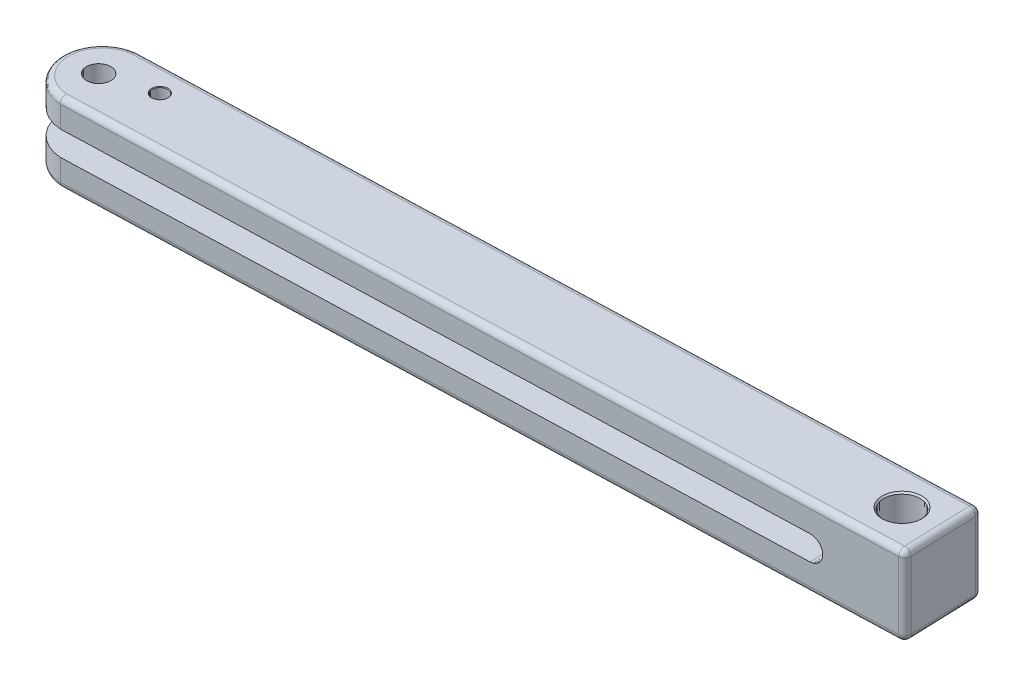
ISO-10303-21;
HEADER;
FILE_DESCRIPTION(('STEP AP214'),'2;1');
FILE_NAME('part.step','',(''),(''),'','','');
FILE_SCHEMA(('AUTOMOTIVE_DESIGN { 1 0 10303 214 1 1 1 1 }'));
ENDSEC;
DATA;
#1=APPLICATION_CONTEXT('core data for automotive mechanical design processes');
#2=APPLICATION_PROTOCOL_DEFINITION('international standard','automotive_design',2000,#1);
#3=PRODUCT_CONTEXT('',#1,'mechanical');
#4=PRODUCT('Part','Part','',(#3));
#5=PRODUCT_RELATED_PRODUCT_CATEGORY('part','',(#4));
#6=PRODUCT_DEFINITION_FORMATION('','',#4);
#7=PRODUCT_DEFINITION_CONTEXT('part definition',#1,'design');
#8=PRODUCT_DEFINITION('design','',#6,#7);
#9=PRODUCT_DEFINITION_SHAPE('','',#8);
#10=(LENGTH_UNIT() NAMED_UNIT(*) SI_UNIT(.MILLI.,.METRE.));
#11=(NAMED_UNIT(*) PLANE_ANGLE_UNIT() SI_UNIT($,.RADIAN.));
#12=(NAMED_UNIT(*) SI_UNIT($,.STERADIAN.) SOLID_ANGLE_UNIT());
#13=UNCERTAINTY_MEASURE_WITH_UNIT(LENGTH_MEASURE(1.E-05),#10,'distance_accuracy_value','');
#14=(GEOMETRIC_REPRESENTATION_CONTEXT(3) GLOBAL_UNCERTAINTY_ASSIGNED_CONTEXT((#13)) GLOBAL_UNIT_ASSIGNED_CONTEXT((#10,
#11,#12)) REPRESENTATION_CONTEXT('',''));
#15=CARTESIAN_POINT('',(0.,0.,0.));
#16=DIRECTION('',(0.,0.,1.));
#17=DIRECTION('',(1.,0.,0.));
#18=AXIS2_PLACEMENT_3D('',#15,#16,#17);
#19=CARTESIAN_POINT('',(5.24913966861859,-6.5,-1.));
#20=DIRECTION('',(0.0337078651685393,0.,0.999431728446611));
#21=DIRECTION('',(0.999431728446611,0.,-0.0337078651685393));
#22=AXIS2_PLACEMENT_3D('',#19,#20,#21);
#23=PLANE('',#22);
#24=DIRECTION('',(0.,1.,0.));
#25=VECTOR('',#24,1.);
#26=CARTESIAN_POINT('',(5.24913966861859,-6.5,-1.));
#27=LINE('',#26,#25);
#28=CARTESIAN_POINT('',(5.24913966861859,-5.5,-1.));
#29=VERTEX_POINT('',#28);
#30=CARTESIAN_POINT('',(5.2491396686186,-1.99999999999999,-1.));
#31=VERTEX_POINT('',#30);
#32=EDGE_CURVE('E249',#29,#31,#27,.T.);
#33=ORIENTED_EDGE('',*,*,#32,.F.);
#34=DIRECTION('',(0.999431728446611,0.,-0.0337078651685393));
#35=VECTOR('',#34,1.);
#36=CARTESIAN_POINT('',(138.673275416241,-5.5,-5.5));
#37=LINE('',#36,#35);
#38=CARTESIAN_POINT('',(137.673843687795,-5.5,-5.46629213483146));
#39=VERTEX_POINT('',#38);
#40=EDGE_CURVE('E336',#29,#39,#37,.T.);
#41=ORIENTED_EDGE('',*,*,#40,.T.);
#42=DIRECTION('',(0.,1.,0.));
#43=VECTOR('',#42,1.);
#44=CARTESIAN_POINT('',(137.673843687795,-6.5,-5.46629213483146));
#45=LINE('',#44,#43);
#46=CARTESIAN_POINT('',(137.673843687795,5.5,-5.46629213483146));
#47=VERTEX_POINT('',#46);
#48=EDGE_CURVE('E333',#39,#47,#45,.T.);
#49=ORIENTED_EDGE('',*,*,#48,.T.);
#50=DIRECTION('',(0.999431728446611,0.,-0.0337078651685393));
#51=VECTOR('',#50,1.);
#52=CARTESIAN_POINT('',(5.24913966861859,5.5,-1.));
#53=LINE('',#52,#51);
#54=CARTESIAN_POINT('',(5.24913966861859,5.5,-1.));
#55=VERTEX_POINT('',#54);
#56=EDGE_CURVE('E330',#47,#55,#53,.F.);
#57=ORIENTED_EDGE('',*,*,#56,.T.);
#58=CARTESIAN_POINT('',(5.2491396686186,1.99999999999999,-1.));
#59=VERTEX_POINT('',#58);
#60=EDGE_CURVE('E253',#59,#55,#27,.T.);
#61=ORIENTED_EDGE('',*,*,#60,.F.);
#62=DIRECTION('',(-0.999431728446611,0.,0.0337078651685393));
#63=VECTOR('',#62,1.);
#64=CARTESIAN_POINT('',(-0.0277245315588536,1.99999999999999,-0.822027036055045));
#65=LINE('',#64,#63);
#66=CARTESIAN_POINT('',(123.681799489542,2.,-4.99438202247191));
#67=VERTEX_POINT('',#66);
#68=EDGE_CURVE('E235',#67,#59,#65,.T.);
#69=ORIENTED_EDGE('',*,*,#68,.F.);
#70=CARTESIAN_POINT('',(123.681799489542,0.,-4.99438202247191));
#71=DIRECTION('',(0.0337078651685393,0.,0.999431728446611));
#72=DIRECTION('',(0.999431728446611,0.,-0.0337078651685393));
#73=AXIS2_PLACEMENT_3D('',#70,#71,#72);
#74=CIRCLE('',#73,2.);
#75=CARTESIAN_POINT('',(123.681799489542,-2.,-4.99438202247191));
#76=VERTEX_POINT('',#75);
#77=EDGE_CURVE('E213',#67,#76,#74,.F.);
#78=ORIENTED_EDGE('',*,*,#77,.T.);
#79=DIRECTION('',(-0.999431728446611,0.,0.0337078651685393));
#80=VECTOR('',#79,1.);
#81=CARTESIAN_POINT('',(-0.0277245315588536,-1.99999999999999,-0.822027036055045));
#82=LINE('',#81,#80);
#83=EDGE_CURVE('E223',#76,#31,#82,.T.);
#84=ORIENTED_EDGE('',*,*,#83,.T.);
#85=EDGE_LOOP('',(#33,#41,#49,#57,#61,#69,#78,#84));
#86=FACE_BOUND('',#85,.T.);
#87=ADVANCED_FACE('F49',(#86),#23,.T.);
#88=CARTESIAN_POINT('',(5.60265877617611,-6.5,-7.49037936029873));
#89=DIRECTION('',(0.,1.,0.));
#90=DIRECTION('',(0.,0.,1.));
#91=AXIS2_PLACEMENT_3D('',#88,#89,#90);
#92=CYLINDRICAL_SURFACE('',#91,6.5);
#93=DIRECTION('',(0.,1.,0.));
#94=VECTOR('',#93,1.);
#95=CARTESIAN_POINT('',(4.81263800426407,-6.5,-13.9421905153115));
#96=LINE('',#95,#94);
#97=CARTESIAN_POINT('',(4.81263800426407,-5.5,-13.9421905153115));
#98=VERTEX_POINT('',#97);
#99=CARTESIAN_POINT('',(4.81263800426407,-1.99999999999999,-13.9421905153115));
#100=VERTEX_POINT('',#99);
#101=EDGE_CURVE('E205',#98,#100,#96,.T.);
#102=ORIENTED_EDGE('',*,*,#101,.F.);
#103=CARTESIAN_POINT('',(5.60265877617611,-5.5,-7.49037936029873));
#104=DIRECTION('',(0.,1.,0.));
#105=DIRECTION('',(0.,0.,1.));
#106=AXIS2_PLACEMENT_3D('',#103,#104,#105);
#107=CIRCLE('',#106,6.5);
#108=EDGE_CURVE('E327',#98,#29,#107,.T.);
#109=ORIENTED_EDGE('',*,*,#108,.T.);
#110=ORIENTED_EDGE('',*,*,#32,.T.);
#111=CARTESIAN_POINT('',(5.60265877617611,-1.99999999999999,-7.49037936029873));
#112=DIRECTION('',(0.,1.,0.));
#113=DIRECTION('',(-1.,0.,0.));
#114=AXIS2_PLACEMENT_3D('',#111,#112,#113);
#115=CIRCLE('',#114,6.5);
#116=EDGE_CURVE('E208',#31,#100,#115,.F.);
#117=ORIENTED_EDGE('',*,*,#116,.T.);
#118=EDGE_LOOP('',(#102,#109,#110,#117));
#119=FACE_BOUND('',#118,.T.);
#120=ADVANCED_FACE('F457',(#119),#92,.T.);
#121=CARTESIAN_POINT('',(138.236773751887,-6.5,-18.4421905153116));
#122=DIRECTION('',(-0.0337078651685397,0.,-0.999431728446611));
#123=DIRECTION('',(-0.999431728446611,0.,0.0337078651685397));
#124=AXIS2_PLACEMENT_3D('',#121,#122,#123);
#125=PLANE('',#124);
#126=DIRECTION('',(0.,1.,0.));
#127=VECTOR('',#126,1.);
#128=CARTESIAN_POINT('',(137.23734202344,-6.5,-18.408482650143));
#129=LINE('',#128,#127);
#130=CARTESIAN_POINT('',(137.23734202344,5.5,-18.408482650143));
#131=VERTEX_POINT('',#130);
#132=CARTESIAN_POINT('',(137.23734202344,-5.5,-18.408482650143));
#133=VERTEX_POINT('',#132);
#134=EDGE_CURVE('E321',#131,#133,#129,.F.);
#135=ORIENTED_EDGE('',*,*,#134,.T.);
#136=DIRECTION('',(-0.999431728446611,0.,0.0337078651685397));
#137=VECTOR('',#136,1.);
#138=CARTESIAN_POINT('',(4.81263800426407,-5.5,-13.9421905153115));
#139=LINE('',#138,#137);
#140=EDGE_CURVE('E324',#133,#98,#139,.T.);
#141=ORIENTED_EDGE('',*,*,#140,.T.);
#142=ORIENTED_EDGE('',*,*,#101,.T.);
#143=DIRECTION('',(0.999431728446611,0.,-0.0337078651685397));
#144=VECTOR('',#143,1.);
#145=CARTESIAN_POINT('',(138.236773751887,-2.,-18.4421905153116));
#146=LINE('',#145,#144);
#147=CARTESIAN_POINT('',(13.879577635795,-1.99999999999999,-14.2479914718871));
#148=VERTEX_POINT('',#147);
#149=EDGE_CURVE('E195',#100,#148,#146,.T.);
#150=ORIENTED_EDGE('',*,*,#149,.T.);
#151=CARTESIAN_POINT('',(8.57049077011085,0.,-14.0689317330946));
#152=DIRECTION('',(-0.0337078651685397,0.,-0.999431728446611));
#153=DIRECTION('',(-0.999431728446611,0.,0.0337078651685397));
#154=AXIS2_PLACEMENT_3D('',#151,#152,#153);
#155=CIRCLE('',#154,5.67613122975822);
#156=CARTESIAN_POINT('',(13.879577635795,1.99999999999999,-14.2479914718871));
#157=VERTEX_POINT('',#156);
#158=EDGE_CURVE('E175',#157,#148,#155,.T.);
#159=ORIENTED_EDGE('',*,*,#158,.F.);
#160=DIRECTION('',(0.999431728446611,0.,-0.0337078651685397));
#161=VECTOR('',#160,1.);
#162=CARTESIAN_POINT('',(138.236773751887,2.,-18.4421905153116));
#163=LINE('',#162,#161);
#164=CARTESIAN_POINT('',(4.81263800426407,1.99999999999999,-13.9421905153115));
#165=VERTEX_POINT('',#164);
#166=EDGE_CURVE('E199',#165,#157,#163,.T.);
#167=ORIENTED_EDGE('',*,*,#166,.F.);
#168=CARTESIAN_POINT('',(4.81263800426407,5.5,-13.9421905153115));
#169=VERTEX_POINT('',#168);
#170=EDGE_CURVE('E245',#165,#169,#96,.T.);
#171=ORIENTED_EDGE('',*,*,#170,.T.);
#172=DIRECTION('',(-0.999431728446611,0.,0.0337078651685397));
#173=VECTOR('',#172,1.);
#174=CARTESIAN_POINT('',(138.236773751887,5.5,-18.4421905153116));
#175=LINE('',#174,#173);
#176=EDGE_CURVE('E318',#169,#131,#175,.F.);
#177=ORIENTED_EDGE('',*,*,#176,.T.);
#178=EDGE_LOOP('',(#135,#141,#142,#150,#159,#167,#171,#177));
#179=FACE_BOUND('',#178,.T.);
#180=ADVANCED_FACE('F203',(#179),#125,.T.);
#181=CARTESIAN_POINT('',(138.673275416241,-6.5,-5.5));
#182=DIRECTION('',(0.999431728446611,0.,-0.0337078651685386));
#183=DIRECTION('',(-0.0337078651685386,0.,-0.999431728446611));
#184=AXIS2_PLACEMENT_3D('',#181,#182,#183);
#185=PLANE('',#184);
#186=DIRECTION('',(0.,1.,0.));
#187=VECTOR('',#186,1.);
#188=CARTESIAN_POINT('',(138.639567551073,-6.5,-6.49943172844661));
#189=LINE('',#188,#187);
#190=CARTESIAN_POINT('',(138.639567551073,5.5,-6.49943172844661));
#191=VERTEX_POINT('',#190);
#192=CARTESIAN_POINT('',(138.639567551073,-5.5,-6.49943172844661));
#193=VERTEX_POINT('',#192);
#194=EDGE_CURVE('E295',#191,#193,#189,.F.);
#195=ORIENTED_EDGE('',*,*,#194,.T.);
#196=DIRECTION('',(-0.0337078651685386,0.,-0.999431728446611));
#197=VECTOR('',#196,1.);
#198=CARTESIAN_POINT('',(138.236773751887,-5.5,-18.4421905153116));
#199=LINE('',#198,#197);
#200=CARTESIAN_POINT('',(138.270481617055,-5.5,-17.442758786865));
#201=VERTEX_POINT('',#200);
#202=EDGE_CURVE('E301',#193,#201,#199,.T.);
#203=ORIENTED_EDGE('',*,*,#202,.T.);
#204=DIRECTION('',(0.,1.,0.));
#205=VECTOR('',#204,1.);
#206=CARTESIAN_POINT('',(138.270481617055,-6.5,-17.442758786865));
#207=LINE('',#206,#205);
#208=CARTESIAN_POINT('',(138.270481617055,5.5,-17.442758786865));
#209=VERTEX_POINT('',#208);
#210=EDGE_CURVE('E298',#201,#209,#207,.T.);
#211=ORIENTED_EDGE('',*,*,#210,.T.);
#212=DIRECTION('',(-0.0337078651685386,0.,-0.999431728446611));
#213=VECTOR('',#212,1.);
#214=CARTESIAN_POINT('',(138.673275416241,5.5,-5.5));
#215=LINE('',#214,#213);
#216=EDGE_CURVE('E292',#209,#191,#215,.F.);
#217=ORIENTED_EDGE('',*,*,#216,.T.);
#218=EDGE_LOOP('',(#195,#203,#211,#217));
#219=FACE_BOUND('',#218,.T.);
#220=ADVANCED_FACE('F473',(#219),#185,.T.);
#221=ORIENTED_EDGE('',*,*,#60,.T.);
#222=CARTESIAN_POINT('',(5.60265877617611,5.5,-7.49037936029873));
#223=DIRECTION('',(0.,1.,0.));
#224=DIRECTION('',(0.,0.,1.));
#225=AXIS2_PLACEMENT_3D('',#222,#223,#224);
#226=CIRCLE('',#225,6.5);
#227=EDGE_CURVE('E11',#55,#169,#226,.F.);
#228=ORIENTED_EDGE('',*,*,#227,.T.);
#229=ORIENTED_EDGE('',*,*,#170,.F.);
#230=CARTESIAN_POINT('',(5.60265877617611,1.99999999999999,-7.49037936029873));
#231=DIRECTION('',(0.,1.,0.));
#232=DIRECTION('',(-1.,0.,0.));
#233=AXIS2_PLACEMENT_3D('',#230,#231,#232);
#234=CIRCLE('',#233,6.5);
#235=EDGE_CURVE('E209',#59,#165,#234,.F.);
#236=ORIENTED_EDGE('',*,*,#235,.F.);
#237=EDGE_LOOP('',(#221,#228,#229,#236));
#238=FACE_BOUND('',#237,.T.);
#239=ADVANCED_FACE('F466',(#238),#92,.T.);
#240=CARTESIAN_POINT('',(5.60265877617611,-6.5,-7.49037936029873));
#241=DIRECTION('',(0.,1.,0.));
#242=DIRECTION('',(0.,0.,1.));
#243=AXIS2_PLACEMENT_3D('',#240,#241,#242);
#244=PLANE('',#243);
#245=DIRECTION('',(-0.999431728446611,0.,0.0337078651685397));
#246=VECTOR('',#245,1.);
#247=CARTESIAN_POINT('',(138.270481617055,-6.5,-17.442758786865));
#248=LINE('',#247,#246);
#249=CARTESIAN_POINT('',(4.89225692803838,-6.5,-12.9443072305737));
#250=VERTEX_POINT('',#249);
#251=CARTESIAN_POINT('',(137.271049888609,-6.5,-17.4090509216964));
#252=VERTEX_POINT('',#251);
#253=EDGE_CURVE('E311',#250,#252,#248,.F.);
#254=ORIENTED_EDGE('',*,*,#253,.T.);
#255=DIRECTION('',(-0.0337078651685386,0.,-0.999431728446611));
#256=VECTOR('',#255,1.);
#257=CARTESIAN_POINT('',(137.673843687795,-6.5,-5.46629213483146));
#258=LINE('',#257,#256);
#259=CARTESIAN_POINT('',(137.640135822626,-6.5,-6.46572386327807));
#260=VERTEX_POINT('',#259);
#261=EDGE_CURVE('E314',#252,#260,#258,.F.);
#262=ORIENTED_EDGE('',*,*,#261,.T.);
#263=DIRECTION('',(0.999431728446611,0.,-0.0337078651685393));
#264=VECTOR('',#263,1.);
#265=CARTESIAN_POINT('',(5.21543180345005,-6.5,-1.99943172844661));
#266=LINE('',#265,#264);
#267=CARTESIAN_POINT('',(5.26134286205578,-6.5,-2.00098017215635));
#268=VERTEX_POINT('',#267);
#269=EDGE_CURVE('E305',#260,#268,#266,.F.);
#270=ORIENTED_EDGE('',*,*,#269,.T.);
#271=CARTESIAN_POINT('',(5.60265877617611,-6.5,-7.49037936029873));
#272=DIRECTION('',(0.,1.,0.));
#273=DIRECTION('',(0.,0.,1.));
#274=AXIS2_PLACEMENT_3D('',#271,#272,#273);
#275=CIRCLE('',#274,5.5);
#276=EDGE_CURVE('E308',#268,#250,#275,.F.);
#277=ORIENTED_EDGE('',*,*,#276,.T.);
#278=EDGE_LOOP('',(#254,#262,#270,#277));
#279=FACE_BOUND('',#278,.T.);
#280=CARTESIAN_POINT('',(131.959568640579,-6.5,-11.7267831568131));
#281=DIRECTION('',(0.,1.,0.));
#282=DIRECTION('',(0.,0.,1.));
#283=AXIS2_PLACEMENT_3D('',#280,#281,#282);
#284=CIRCLE('',#283,3.24999999999995);
#285=CARTESIAN_POINT('',(131.959568640579,-6.5,-8.47678315681314));
#286=VERTEX_POINT('',#285);
#287=EDGE_CURVE('E288',#286,#286,#284,.T.);
#288=ORIENTED_EDGE('',*,*,#287,.T.);
#289=EDGE_LOOP('',(#288));
#290=FACE_BOUND('',#289,.T.);
#291=CARTESIAN_POINT('',(5.03088883644133,-6.5,-7.47109525765576));
#292=DIRECTION('',(0.,1.,0.));
#293=DIRECTION('',(0.,0.,1.));
#294=AXIS2_PLACEMENT_3D('',#291,#292,#293);
#295=CIRCLE('',#294,2.);
#296=CARTESIAN_POINT('',(5.03088883644133,-6.5,-5.47109525765576));
#297=VERTEX_POINT('',#296);
#298=EDGE_CURVE('E553',#297,#297,#295,.T.);
#299=ORIENTED_EDGE('',*,*,#298,.T.);
#300=EDGE_LOOP('',(#299));
#301=FACE_BOUND('',#300,.T.);
#302=CARTESIAN_POINT('',(12.7819733684952,-6.5,-9.70841386241665));
#303=DIRECTION('',(0.,1.,0.));
#304=DIRECTION('',(0.,0.,1.));
#305=AXIS2_PLACEMENT_3D('',#302,#303,#304);
#306=CIRCLE('',#305,1.34999999999992);
#307=CARTESIAN_POINT('',(12.7819733684952,-6.5,-8.35841386241673));
#308=VERTEX_POINT('',#307);
#309=EDGE_CURVE('E252',#308,#308,#306,.T.);
#310=ORIENTED_EDGE('',*,*,#309,.T.);
#311=EDGE_LOOP('',(#310));
#312=FACE_BOUND('',#311,.T.);
#313=ADVANCED_FACE('F469',(#279,#290,#301,#312),#244,.F.);
#314=CARTESIAN_POINT('',(5.60265877617611,6.5,-7.49037936029873));
#315=DIRECTION('',(0.,1.,0.));
#316=DIRECTION('',(0.,0.,1.));
#317=AXIS2_PLACEMENT_3D('',#314,#315,#316);
#318=PLANE('',#317);
#319=DIRECTION('',(0.999431728446611,0.,-0.0337078651685393));
#320=VECTOR('',#319,1.);
#321=CARTESIAN_POINT('',(5.78720174318483,6.5,-2.01871583108958));
#322=LINE('',#321,#320);
#323=CARTESIAN_POINT('',(5.26134286205577,6.5,-2.00098017215726));
#324=VERTEX_POINT('',#323);
#325=CARTESIAN_POINT('',(137.640135822626,6.5,-6.46572386327807));
#326=VERTEX_POINT('',#325);
#327=EDGE_CURVE('E73',#324,#326,#322,.T.);
#328=ORIENTED_EDGE('',*,*,#327,.T.);
#329=DIRECTION('',(-0.0337078651685386,0.,-0.999431728446611));
#330=VECTOR('',#329,1.);
#331=CARTESIAN_POINT('',(137.455592855617,6.5,-11.9373873924871));
#332=LINE('',#331,#330);
#333=CARTESIAN_POINT('',(137.271049888609,6.5,-17.4090509216964));
#334=VERTEX_POINT('',#333);
#335=EDGE_CURVE('E65',#326,#334,#332,.T.);
#336=ORIENTED_EDGE('',*,*,#335,.T.);
#337=DIRECTION('',(-0.999431728446611,0.,0.0337078651685397));
#338=VECTOR('',#337,1.);
#339=CARTESIAN_POINT('',(5.41811580916738,6.5,-12.9620428895079));
#340=LINE('',#339,#338);
#341=CARTESIAN_POINT('',(4.89225692803835,6.5,-12.9443072305746));
#342=VERTEX_POINT('',#341);
#343=EDGE_CURVE('E339',#334,#342,#340,.T.);
#344=ORIENTED_EDGE('',*,*,#343,.T.);
#345=CARTESIAN_POINT('',(5.60265877617611,6.5,-7.49037936029873));
#346=DIRECTION('',(0.,1.,0.));
#347=DIRECTION('',(0.,0.,1.));
#348=AXIS2_PLACEMENT_3D('',#345,#346,#347);
#349=CIRCLE('',#348,5.5);
#350=EDGE_CURVE('E78',#342,#324,#349,.T.);
#351=ORIENTED_EDGE('',*,*,#350,.T.);
#352=EDGE_LOOP('',(#328,#336,#344,#351));
#353=FACE_BOUND('',#352,.T.);
#354=CARTESIAN_POINT('',(131.959568640579,6.5,-11.7267831568131));
#355=DIRECTION('',(0.,1.,0.));
#356=DIRECTION('',(0.,0.,1.));
#357=AXIS2_PLACEMENT_3D('',#354,#355,#356);
#358=CIRCLE('',#357,3.25000000000002);
#359=CARTESIAN_POINT('',(131.959568640579,6.5,-8.47678315681307));
#360=VERTEX_POINT('',#359);
#361=EDGE_CURVE('E284',#360,#360,#358,.F.);
#362=ORIENTED_EDGE('',*,*,#361,.T.);
#363=EDGE_LOOP('',(#362));
#364=FACE_BOUND('',#363,.T.);
#365=CARTESIAN_POINT('',(5.03088883644133,6.5,-7.47109525765576));
#366=DIRECTION('',(0.,1.,0.));
#367=DIRECTION('',(0.,0.,1.));
#368=AXIS2_PLACEMENT_3D('',#365,#366,#367);
#369=CIRCLE('',#368,2.);
#370=CARTESIAN_POINT('',(5.03088883644133,6.5,-5.47109525765576));
#371=VERTEX_POINT('',#370);
#372=EDGE_CURVE('E276',#371,#371,#369,.T.);
#373=ORIENTED_EDGE('',*,*,#372,.F.);
#374=EDGE_LOOP('',(#373));
#375=FACE_BOUND('',#374,.T.);
#376=CARTESIAN_POINT('',(12.7819733684952,6.5,-9.70841386241665));
#377=DIRECTION('',(0.,1.,0.));
#378=DIRECTION('',(0.,0.,1.));
#379=AXIS2_PLACEMENT_3D('',#376,#377,#378);
#380=CIRCLE('',#379,1.35000000000007);
#381=CARTESIAN_POINT('',(12.7819733684952,6.5,-8.35841386241658));
#382=VERTEX_POINT('',#381);
#383=EDGE_CURVE('E267',#382,#382,#380,.F.);
#384=ORIENTED_EDGE('',*,*,#383,.T.);
#385=EDGE_LOOP('',(#384));
#386=FACE_BOUND('',#385,.T.);
#387=ADVANCED_FACE('F603',(#353,#364,#375,#386),#318,.T.);
#388=CARTESIAN_POINT('',(123.462698365946,0.,-11.4906882573749));
#389=DIRECTION('',(0.0337078651685393,0.,0.999431728446611));
#390=DIRECTION('',(0.999431728446611,0.,-0.0337078651685393));
#391=AXIS2_PLACEMENT_3D('',#388,#389,#390);
#392=CYLINDRICAL_SURFACE('',#391,2.);
#393=ORIENTED_EDGE('',*,*,#77,.F.);
#394=DIRECTION('',(0.0337078651685393,0.,0.999431728446611));
#395=VECTOR('',#394,1.);
#396=CARTESIAN_POINT('',(123.462698365946,2.,-11.4906882573749));
#397=LINE('',#396,#395);
#398=CARTESIAN_POINT('',(123.462698365946,2.,-11.4906882573749));
#399=VERTEX_POINT('',#398);
#400=EDGE_CURVE('E231',#399,#67,#397,.T.);
#401=ORIENTED_EDGE('',*,*,#400,.F.);
#402=CARTESIAN_POINT('',(123.462698365946,0.,-11.4906882573749));
#403=DIRECTION('',(0.0337078651685393,0.,0.999431728446611));
#404=DIRECTION('',(0.999431728446611,0.,-0.0337078651685393));
#405=AXIS2_PLACEMENT_3D('',#402,#403,#404);
#406=CIRCLE('',#405,2.);
#407=CARTESIAN_POINT('',(123.462698365946,-2.,-11.4906882573749));
#408=VERTEX_POINT('',#407);
#409=EDGE_CURVE('E218',#399,#408,#406,.F.);
#410=ORIENTED_EDGE('',*,*,#409,.T.);
#411=DIRECTION('',(0.0337078651685393,0.,0.999431728446611));
#412=VECTOR('',#411,1.);
#413=CARTESIAN_POINT('',(123.462698365946,-2.,-11.4906882573749));
#414=LINE('',#413,#412);
#415=EDGE_CURVE('E241',#408,#76,#414,.T.);
#416=ORIENTED_EDGE('',*,*,#415,.T.);
#417=EDGE_LOOP('',(#393,#401,#410,#416));
#418=FACE_BOUND('',#417,.T.);
#419=ADVANCED_FACE('F606',(#418),#392,.F.);
#420=CARTESIAN_POINT('',(-0.246825655154359,-1.99999999999999,-7.31833327095801));
#421=DIRECTION('',(0.,1.,0.));
#422=DIRECTION('',(-1.,0.,0.));
#423=AXIS2_PLACEMENT_3D('',#420,#421,#422);
#424=PLANE('',#423);
#425=CARTESIAN_POINT('',(5.03088883644133,-1.99999999999999,-7.47109525765576));
#426=DIRECTION('',(0.,1.,0.));
#427=DIRECTION('',(-1.,0.,0.));
#428=AXIS2_PLACEMENT_3D('',#425,#426,#427);
#429=CIRCLE('',#428,2.);
#430=CARTESIAN_POINT('',(3.03088883644133,-1.99999999999999,-7.47109525765576));
#431=VERTEX_POINT('',#430);
#432=EDGE_CURVE('E188',#431,#431,#429,.T.);
#433=ORIENTED_EDGE('',*,*,#432,.F.);
#434=EDGE_LOOP('',(#433));
#435=FACE_BOUND('',#434,.T.);
#436=ORIENTED_EDGE('',*,*,#116,.F.);
#437=ORIENTED_EDGE('',*,*,#83,.F.);
#438=ORIENTED_EDGE('',*,*,#415,.F.);
#439=DIRECTION('',(-0.999431728446611,0.,0.0337078651685393));
#440=VECTOR('',#439,1.);
#441=CARTESIAN_POINT('',(-0.246825655154359,-1.99999999999999,-7.31833327095801));
#442=LINE('',#441,#440);
#443=CARTESIAN_POINT('',(14.0969781765541,-1.99999999999999,-7.80210719147852));
#444=VERTEX_POINT('',#443);
#445=EDGE_CURVE('E227',#408,#444,#442,.T.);
#446=ORIENTED_EDGE('',*,*,#445,.T.);
#447=DIRECTION('',(0.0337078651685393,0.,0.999431728446611));
#448=VECTOR('',#447,1.);
#449=CARTESIAN_POINT('',(13.7214906474373,-1.99999999999999,-18.9352403151252));
#450=LINE('',#449,#448);
#451=CARTESIAN_POINT('',(14.0312630290535,-1.99999999999999,-9.75054869387733));
#452=VERTEX_POINT('',#451);
#453=EDGE_CURVE('E200',#452,#444,#450,.T.);
#454=ORIENTED_EDGE('',*,*,#453,.F.);
#455=CARTESIAN_POINT('',(12.7819733684952,-1.99999999999999,-9.70841386241665));
#456=DIRECTION('',(0.,1.,0.));
#457=DIRECTION('',(-1.,0.,0.));
#458=AXIS2_PLACEMENT_3D('',#455,#456,#457);
#459=CIRCLE('',#458,1.25);
#460=EDGE_CURVE('E197',#452,#452,#459,.T.);
#461=ORIENTED_EDGE('',*,*,#460,.F.);
#462=EDGE_CURVE('E178',#148,#452,#450,.T.);
#463=ORIENTED_EDGE('',*,*,#462,.F.);
#464=ORIENTED_EDGE('',*,*,#149,.F.);
#465=EDGE_LOOP('',(#436,#437,#438,#446,#454,#461,#463,#464));
#466=FACE_BOUND('',#465,.T.);
#467=ADVANCED_FACE('F194',(#435,#466),#424,.T.);
#468=CARTESIAN_POINT('',(-0.246825655154359,1.99999999999999,-7.31833327095801));
#469=DIRECTION('',(0.,1.,0.));
#470=DIRECTION('',(-1.,0.,0.));
#471=AXIS2_PLACEMENT_3D('',#468,#469,#470);
#472=PLANE('',#471);
#473=CARTESIAN_POINT('',(5.03088883644133,1.99999999999998,-7.47109525765576));
#474=DIRECTION('',(0.,1.,0.));
#475=DIRECTION('',(-1.,0.,0.));
#476=AXIS2_PLACEMENT_3D('',#473,#474,#475);
#477=CIRCLE('',#476,2.);
#478=CARTESIAN_POINT('',(3.03088883644133,1.99999999999998,-7.47109525765576));
#479=VERTEX_POINT('',#478);
#480=EDGE_CURVE('E272',#479,#479,#477,.T.);
#481=ORIENTED_EDGE('',*,*,#480,.T.);
#482=EDGE_LOOP('',(#481));
#483=FACE_BOUND('',#482,.T.);
#484=DIRECTION('',(0.0337078651685393,0.,0.999431728446611));
#485=VECTOR('',#484,1.);
#486=CARTESIAN_POINT('',(13.7214906474373,1.99999999999999,-18.9352403151252));
#487=LINE('',#486,#485);
#488=CARTESIAN_POINT('',(14.0312630290535,1.99999999999999,-9.75054869387733));
#489=VERTEX_POINT('',#488);
#490=CARTESIAN_POINT('',(14.0969781765541,1.99999999999999,-7.80210719147852));
#491=VERTEX_POINT('',#490);
#492=EDGE_CURVE('E570',#489,#491,#487,.T.);
#493=ORIENTED_EDGE('',*,*,#492,.T.);
#494=DIRECTION('',(-0.999431728446611,0.,0.0337078651685393));
#495=VECTOR('',#494,1.);
#496=CARTESIAN_POINT('',(-0.246825655154359,1.99999999999999,-7.31833327095801));
#497=LINE('',#496,#495);
#498=EDGE_CURVE('E222',#399,#491,#497,.T.);
#499=ORIENTED_EDGE('',*,*,#498,.F.);
#500=ORIENTED_EDGE('',*,*,#400,.T.);
#501=ORIENTED_EDGE('',*,*,#68,.T.);
#502=ORIENTED_EDGE('',*,*,#235,.T.);
#503=ORIENTED_EDGE('',*,*,#166,.T.);
#504=EDGE_CURVE('E181',#157,#489,#487,.T.);
#505=ORIENTED_EDGE('',*,*,#504,.T.);
#506=CARTESIAN_POINT('',(12.7819733684952,1.99999999999999,-9.70841386241665));
#507=DIRECTION('',(0.,1.,0.));
#508=DIRECTION('',(-1.,0.,0.));
#509=AXIS2_PLACEMENT_3D('',#506,#507,#508);
#510=CIRCLE('',#509,1.25);
#511=EDGE_CURVE('E564',#489,#489,#510,.T.);
#512=ORIENTED_EDGE('',*,*,#511,.T.);
#513=EDGE_LOOP('',(#493,#499,#500,#501,#502,#503,#505,#512));
#514=FACE_BOUND('',#513,.T.);
#515=ADVANCED_FACE('F578',(#483,#514),#472,.F.);
#516=CARTESIAN_POINT('',(-0.246825655154359,0.,-7.31833327095801));
#517=DIRECTION('',(0.0337078651685393,0.,0.999431728446611));
#518=DIRECTION('',(0.999431728446611,0.,-0.0337078651685393));
#519=AXIS2_PLACEMENT_3D('',#516,#517,#518);
#520=PLANE('',#519);
#521=CARTESIAN_POINT('',(8.78789131086988,0.,-7.62304745268606));
#522=DIRECTION('',(0.0337078651685393,0.,0.999431728446611));
#523=DIRECTION('',(0.999431728446611,0.,-0.0337078651685393));
#524=AXIS2_PLACEMENT_3D('',#521,#522,#523);
#525=CIRCLE('',#524,5.67613122975822);
#526=EDGE_CURVE('E187',#444,#491,#525,.T.);
#527=ORIENTED_EDGE('',*,*,#526,.F.);
#528=ORIENTED_EDGE('',*,*,#445,.F.);
#529=ORIENTED_EDGE('',*,*,#409,.F.);
#530=ORIENTED_EDGE('',*,*,#498,.T.);
#531=EDGE_LOOP('',(#527,#528,#529,#530));
#532=FACE_BOUND('',#531,.T.);
#533=ADVANCED_FACE('F619',(#532),#520,.T.);
#534=CARTESIAN_POINT('',(12.7819733684952,-6.5,-9.70841386241665));
#535=DIRECTION('',(0.,1.,0.));
#536=DIRECTION('',(0.,0.,1.));
#537=AXIS2_PLACEMENT_3D('',#534,#535,#536);
#538=CYLINDRICAL_SURFACE('',#537,1.25);
#539=CARTESIAN_POINT('',(12.7819733684952,6.39999999999993,-9.70841386241665));
#540=DIRECTION('',(0.,1.,0.));
#541=DIRECTION('',(0.,0.,1.));
#542=AXIS2_PLACEMENT_3D('',#539,#540,#541);
#543=CIRCLE('',#542,1.25);
#544=CARTESIAN_POINT('',(12.7819733684952,6.39999999999993,-8.45841386241666));
#545=VERTEX_POINT('',#544);
#546=EDGE_CURVE('E263',#545,#545,#543,.T.);
#547=ORIENTED_EDGE('',*,*,#546,.T.);
#548=EDGE_LOOP('',(#547));
#549=FACE_BOUND('',#548,.T.);
#550=ORIENTED_EDGE('',*,*,#511,.F.);
#551=EDGE_LOOP('',(#550));
#552=FACE_BOUND('',#551,.T.);
#553=ADVANCED_FACE('F615',(#549,#552),#538,.F.);
#554=CARTESIAN_POINT('',(12.7819733684952,-6.40000000000009,-9.70841386241665));
#555=DIRECTION('',(0.,1.,0.));
#556=DIRECTION('',(0.,0.,1.));
#557=AXIS2_PLACEMENT_3D('',#554,#555,#556);
#558=CIRCLE('',#557,1.25);
#559=CARTESIAN_POINT('',(12.7819733684952,-6.40000000000009,-8.45841386241666));
#560=VERTEX_POINT('',#559);
#561=EDGE_CURVE('E259',#560,#560,#558,.F.);
#562=ORIENTED_EDGE('',*,*,#561,.T.);
#563=EDGE_LOOP('',(#562));
#564=FACE_BOUND('',#563,.T.);
#565=ORIENTED_EDGE('',*,*,#460,.T.);
#566=EDGE_LOOP('',(#565));
#567=FACE_BOUND('',#566,.T.);
#568=ADVANCED_FACE('F618',(#564,#567),#538,.F.);
#569=CARTESIAN_POINT('',(9.15859162922977,0.,3.36814579143295));
#570=DIRECTION('',(-0.0337078651685397,0.,-0.999431728446611));
#571=DIRECTION('',(-0.999431728446611,0.,0.0337078651685397));
#572=AXIS2_PLACEMENT_3D('',#569,#570,#571);
#573=CYLINDRICAL_SURFACE('',#572,5.67613122975822);
#574=ORIENTED_EDGE('',*,*,#526,.T.);
#575=ORIENTED_EDGE('',*,*,#492,.F.);
#576=ORIENTED_EDGE('',*,*,#504,.F.);
#577=ORIENTED_EDGE('',*,*,#158,.T.);
#578=ORIENTED_EDGE('',*,*,#462,.T.);
#579=ORIENTED_EDGE('',*,*,#453,.T.);
#580=EDGE_LOOP('',(#574,#575,#576,#577,#578,#579));
#581=FACE_BOUND('',#580,.T.);
#582=ADVANCED_FACE('F177',(#581),#573,.F.);
#583=CARTESIAN_POINT('',(12.7819733684952,-6.5,-9.70841386241665));
#584=DIRECTION('',(0.,-1.,0.));
#585=DIRECTION('',(0.,0.,-1.));
#586=AXIS2_PLACEMENT_3D('',#583,#584,#585);
#587=CONICAL_SURFACE('',#586,1.34999999999992,0.785398163397497);
#588=ORIENTED_EDGE('',*,*,#561,.F.);
#589=EDGE_LOOP('',(#588));
#590=FACE_BOUND('',#589,.T.);
#591=ORIENTED_EDGE('',*,*,#309,.F.);
#592=EDGE_LOOP('',(#591));
#593=FACE_BOUND('',#592,.T.);
#594=ADVANCED_FACE('F481',(#590,#593),#587,.F.);
#595=CARTESIAN_POINT('',(12.7819733684952,6.39999999999993,-9.70841386241665));
#596=DIRECTION('',(0.,1.,0.));
#597=DIRECTION('',(0.,0.,1.));
#598=AXIS2_PLACEMENT_3D('',#595,#596,#597);
#599=CONICAL_SURFACE('',#598,1.25,0.785398163397467);
#600=ORIENTED_EDGE('',*,*,#383,.F.);
#601=EDGE_LOOP('',(#600));
#602=FACE_BOUND('',#601,.T.);
#603=ORIENTED_EDGE('',*,*,#546,.F.);
#604=EDGE_LOOP('',(#603));
#605=FACE_BOUND('',#604,.T.);
#606=ADVANCED_FACE('F487',(#602,#605),#599,.F.);
#607=CARTESIAN_POINT('',(5.03088883644133,-6.5,-7.47109525765576));
#608=DIRECTION('',(0.,1.,0.));
#609=DIRECTION('',(0.,0.,1.));
#610=AXIS2_PLACEMENT_3D('',#607,#608,#609);
#611=CYLINDRICAL_SURFACE('',#610,2.);
#612=ORIENTED_EDGE('',*,*,#372,.T.);
#613=EDGE_LOOP('',(#612));
#614=FACE_BOUND('',#613,.T.);
#615=ORIENTED_EDGE('',*,*,#480,.F.);
#616=EDGE_LOOP('',(#615));
#617=FACE_BOUND('',#616,.T.);
#618=ADVANCED_FACE('F494',(#614,#617),#611,.F.);
#619=ORIENTED_EDGE('',*,*,#432,.T.);
#620=EDGE_LOOP('',(#619));
#621=FACE_BOUND('',#620,.T.);
#622=ORIENTED_EDGE('',*,*,#298,.F.);
#623=EDGE_LOOP('',(#622));
#624=FACE_BOUND('',#623,.T.);
#625=ADVANCED_FACE('F645',(#621,#624),#611,.F.);
#626=CARTESIAN_POINT('',(131.959568640579,-6.5,-11.7267831568131));
#627=DIRECTION('',(0.,1.,0.));
#628=DIRECTION('',(0.,0.,1.));
#629=AXIS2_PLACEMENT_3D('',#626,#627,#628);
#630=CYLINDRICAL_SURFACE('',#629,2.99999999999999);
#631=CARTESIAN_POINT('',(131.959568640579,6.24999999999997,-11.7267831568131));
#632=DIRECTION('',(0.,1.,0.));
#633=DIRECTION('',(0.,0.,1.));
#634=AXIS2_PLACEMENT_3D('',#631,#632,#633);
#635=CIRCLE('',#634,2.99999999999999);
#636=CARTESIAN_POINT('',(131.959568640579,6.24999999999997,-8.7267831568131));
#637=VERTEX_POINT('',#636);
#638=EDGE_CURVE('E280',#637,#637,#635,.T.);
#639=ORIENTED_EDGE('',*,*,#638,.T.);
#640=EDGE_LOOP('',(#639));
#641=FACE_BOUND('',#640,.T.);
#642=CARTESIAN_POINT('',(131.959568640579,-6.25000000000005,-11.7267831568131));
#643=DIRECTION('',(0.,1.,0.));
#644=DIRECTION('',(0.,0.,1.));
#645=AXIS2_PLACEMENT_3D('',#642,#643,#644);
#646=CIRCLE('',#645,2.99999999999999);
#647=CARTESIAN_POINT('',(131.959568640579,-6.25000000000005,-8.7267831568131));
#648=VERTEX_POINT('',#647);
#649=EDGE_CURVE('E271',#648,#648,#646,.F.);
#650=ORIENTED_EDGE('',*,*,#649,.T.);
#651=EDGE_LOOP('',(#650));
#652=FACE_BOUND('',#651,.T.);
#653=ADVANCED_FACE('F502',(#641,#652),#630,.F.);
#654=CARTESIAN_POINT('',(131.959568640579,6.24999999999997,-11.7267831568131));
#655=DIRECTION('',(0.,1.,0.));
#656=DIRECTION('',(0.,0.,1.));
#657=AXIS2_PLACEMENT_3D('',#654,#655,#656);
#658=CONICAL_SURFACE('',#657,2.99999999999999,0.785398163397423);
#659=ORIENTED_EDGE('',*,*,#361,.F.);
#660=EDGE_LOOP('',(#659));
#661=FACE_BOUND('',#660,.T.);
#662=ORIENTED_EDGE('',*,*,#638,.F.);
#663=EDGE_LOOP('',(#662));
#664=FACE_BOUND('',#663,.T.);
#665=ADVANCED_FACE('F496',(#661,#664),#658,.F.);
#666=CARTESIAN_POINT('',(131.959568640579,-6.5,-11.7267831568131));
#667=DIRECTION('',(0.,-1.,0.));
#668=DIRECTION('',(0.,0.,-1.));
#669=AXIS2_PLACEMENT_3D('',#666,#667,#668);
#670=CONICAL_SURFACE('',#669,3.24999999999995,0.785398163397453);
#671=ORIENTED_EDGE('',*,*,#649,.F.);
#672=EDGE_LOOP('',(#671));
#673=FACE_BOUND('',#672,.T.);
#674=ORIENTED_EDGE('',*,*,#287,.F.);
#675=EDGE_LOOP('',(#674));
#676=FACE_BOUND('',#675,.T.);
#677=ADVANCED_FACE('F442',(#673,#676),#670,.F.);
#678=CARTESIAN_POINT('',(5.60265877617611,5.5,-7.49037936029873));
#679=DIRECTION('',(0.,1.,0.));
#680=DIRECTION('',(0.,0.,1.));
#681=AXIS2_PLACEMENT_3D('',#678,#679,#680);
#682=TOROIDAL_SURFACE('',#681,5.5,1.);
#683=CARTESIAN_POINT('',(4.81263800426407,5.5,-13.9421905153115));
#684=CARTESIAN_POINT('',(4.8126380409459,5.52811346535458,-13.9421903431772));
#685=CARTESIAN_POINT('',(4.81273026663011,5.55621345499443,-13.9410066568067));
#686=CARTESIAN_POINT('',(4.81309833592654,5.6122122297955,-13.9362845505924));
#687=CARTESIAN_POINT('',(4.81337417042399,5.64011102487499,-13.9327462476371));
#688=CARTESIAN_POINT('',(4.81447478088274,5.72315941993951,-13.9186328093875));
#689=CARTESIAN_POINT('',(4.8155726697265,5.77775246430937,-13.9045590534429));
#690=CARTESIAN_POINT('',(4.81847002403178,5.88379153005901,-13.8674750417566));
#691=CARTESIAN_POINT('',(4.82026981832773,5.93523606331016,-13.8444605974276));
#692=CARTESIAN_POINT('',(4.82452565119434,6.03351699040058,-13.7901557278599));
#693=CARTESIAN_POINT('',(4.82698153703143,6.08035445326644,-13.7588672287812));
#694=CARTESIAN_POINT('',(4.83248874158015,6.16811533776252,-13.6888917157624));
#695=CARTESIAN_POINT('',(4.8355402706579,6.20903666104815,-13.6502020880278));
#696=CARTESIAN_POINT('',(4.84216190936407,6.28380523971511,-13.5665148829064));
#697=CARTESIAN_POINT('',(4.84573220096297,6.31765000259199,-13.5215150922477));
#698=CARTESIAN_POINT('',(4.85330244928306,6.37732768503178,-13.4264464604386));
#699=CARTESIAN_POINT('',(4.85730292772244,6.40315072514213,-13.3763714685575));
#700=CARTESIAN_POINT('',(4.86562366704508,6.44598321587784,-13.2726382869806));
#701=CARTESIAN_POINT('',(4.86994362395199,6.46300092433663,-13.218983508007));
#702=CARTESIAN_POINT('',(4.87701363472381,6.48281541911877,-13.1315505145332));
#703=CARTESIAN_POINT('',(4.87970039364069,6.48857776120894,-13.0984072094561));
#704=CARTESIAN_POINT('',(4.88511883474946,6.49671964248258,-13.0317430922786));
#705=CARTESIAN_POINT('',(4.8878504452456,6.49910413254909,-12.9982229054087));
#706=CARTESIAN_POINT('',(4.89114580429352,6.4999306124135,-12.9578940594512));
#707=CARTESIAN_POINT('',(4.89170125397017,6.50000018587321,-12.9511001406722));
#708=CARTESIAN_POINT('',(4.89225692804785,6.5,-12.944307230575));
#709=B_SPLINE_CURVE_WITH_KNOTS('',3,(#683,#684,#685,#686,#687,#688,#689,#690,#691,#692,#693,
#694,#695,#696,#697,#698,#699,#700,#701,#702,#703,#704,#705,#706,#707,#708),.UNSPECIFIED.,.F.,
.F.,(4,2,2,2,2,2,2,2,2,2,2,2,4),(0.,0.0842885699678714,0.168572955970086,0.336870917050707,
0.505247818636572,0.673585557346627,0.841982856608001,1.01043936918167,1.17910253557951,
1.34760723794695,1.44870442591284,1.54965328291128,1.57010246297494),.UNSPECIFIED.);
#710=EDGE_CURVE('E429',#169,#342,#709,.T.);
#711=ORIENTED_EDGE('',*,*,#710,.F.);
#712=ORIENTED_EDGE('',*,*,#227,.F.);
#713=CARTESIAN_POINT('',(5.24913966861859,5.5,-1.));
#714=CARTESIAN_POINT('',(5.24913969361909,5.52811346535458,-1.00000017421466));
#715=CARTESIAN_POINT('',(5.24915195599233,5.55621345499443,-1.00118738465713));
#716=CARTESIAN_POINT('',(5.24920102554006,5.6122122297955,-1.0059235597263));
#717=CARTESIAN_POINT('',(5.24923783149614,5.64011102487499,-1.00947240711593));
#718=CARTESIAN_POINT('',(5.24938501382816,5.72315941993951,-1.02362792971209));
#719=CARTESIAN_POINT('',(5.24953215442121,5.77775246430937,-1.03774367680342));
#720=CARTESIAN_POINT('',(5.24992429963488,5.88379153005901,-1.0749386335429));
#721=CARTESIAN_POINT('',(5.25016935012645,5.93523606331016,-1.09802204441602));
#722=CARTESIAN_POINT('',(5.25075658986753,6.03351699040058,-1.15249025644504));
#723=CARTESIAN_POINT('',(5.25109875651022,6.08035445326644,-1.18387312552725));
#724=CARTESIAN_POINT('',(5.25187867674207,6.16811533776252,-1.25406068460014));
#725=CARTESIAN_POINT('',(5.25231646410856,6.20903666104815,-1.29286799661963));
#726=CARTESIAN_POINT('',(5.25328442757643,6.28380523971511,-1.37681117649095));
#727=CARTESIAN_POINT('',(5.25381463611022,6.31765000259199,-1.42194926484597));
#728=CARTESIAN_POINT('',(5.2549622023683,6.37732768503178,-1.51731192265998));
#729=CARTESIAN_POINT('',(5.25557966620485,6.40315072514213,-1.56754266402466));
#730=CARTESIAN_POINT('',(5.25689222301153,6.44598321587784,-1.67160074808147));
#731=CARTESIAN_POINT('',(5.25758724250175,6.46300092433663,-1.72542466732088));
#732=CARTESIAN_POINT('',(5.25875017758188,6.48281541911877,-1.81313533361696));
#733=CARTESIAN_POINT('',(5.25919772061651,6.48857776120894,-1.84638434939404));
#734=CARTESIAN_POINT('',(5.26011219242603,6.49671964248257,-1.9132620569237));
#735=CARTESIAN_POINT('',(5.26057909179449,6.49910413254908,-1.94689012003579));
#736=CARTESIAN_POINT('',(5.26114970874762,6.4999306124135,-1.98734935388683));
#737=CARTESIAN_POINT('',(5.26124613947973,6.50000018587321,-1.99416525865678));
#738=CARTESIAN_POINT('',(5.26134286206529,6.5,-2.00098017215667));
#739=B_SPLINE_CURVE_WITH_KNOTS('',3,(#713,#714,#715,#716,#717,#718,#719,#720,#721,#722,#723,
#724,#725,#726,#727,#728,#729,#730,#731,#732,#733,#734,#735,#736,#737,#738),.UNSPECIFIED.,.F.,
.F.,(4,2,2,2,2,2,2,2,2,2,2,2,4),(0.,0.0842885699678705,0.168572955970085,0.336870917050707,
0.505247818636571,0.673585557346627,0.841982856608001,1.01043936918167,1.17910253557951,
1.34760723794695,1.44870442591283,1.54965328291128,1.57010246297494),.UNSPECIFIED.);
#740=EDGE_CURVE('E54',#324,#55,#739,.F.);
#741=ORIENTED_EDGE('',*,*,#740,.F.);
#742=ORIENTED_EDGE('',*,*,#350,.F.);
#743=EDGE_LOOP('',(#711,#712,#741,#742));
#744=FACE_BOUND('',#743,.T.);
#745=ADVANCED_FACE('F439',(#744),#682,.T.);
#746=CARTESIAN_POINT('',(5.78720174318483,5.5,-2.01871583108958));
#747=DIRECTION('',(0.999431728446611,0.,-0.0337078651685393));
#748=DIRECTION('',(-0.0337078651685393,0.,-0.999431728446611));
#749=AXIS2_PLACEMENT_3D('',#746,#747,#748);
#750=CYLINDRICAL_SURFACE('',#749,1.);
#751=ORIENTED_EDGE('',*,*,#740,.T.);
#752=ORIENTED_EDGE('',*,*,#56,.F.);
#753=CARTESIAN_POINT('',(137.640135822626,5.5,-6.46572386327807));
#754=DIRECTION('',(0.99943172844661,0.,-0.0337078651685419));
#755=DIRECTION('',(-0.0337078651685419,0.,-0.999431728446611));
#756=AXIS2_PLACEMENT_3D('',#753,#754,#755);
#757=CIRCLE('',#756,1.);
#758=EDGE_CURVE('E426',#326,#47,#757,.T.);
#759=ORIENTED_EDGE('',*,*,#758,.F.);
#760=ORIENTED_EDGE('',*,*,#327,.F.);
#761=EDGE_LOOP('',(#751,#752,#759,#760));
#762=FACE_BOUND('',#761,.T.);
#763=ADVANCED_FACE('F51',(#762),#750,.T.);
#764=CARTESIAN_POINT('',(137.455592855617,5.5,-11.9373873924871));
#765=DIRECTION('',(-0.0337078651685386,0.,-0.999431728446611));
#766=DIRECTION('',(-0.999431728446611,0.,0.0337078651685386));
#767=AXIS2_PLACEMENT_3D('',#764,#765,#766);
#768=CYLINDRICAL_SURFACE('',#767,1.);
#769=CARTESIAN_POINT('',(137.271049888609,5.5,-17.4090509216964));
#770=DIRECTION('',(-0.0337078651685421,0.,-0.999431728446611));
#771=DIRECTION('',(-0.999431728446611,0.,0.0337078651685421));
#772=AXIS2_PLACEMENT_3D('',#769,#770,#771);
#773=CIRCLE('',#772,1.);
#774=EDGE_CURVE('E418',#334,#209,#773,.T.);
#775=ORIENTED_EDGE('',*,*,#774,.F.);
#776=ORIENTED_EDGE('',*,*,#335,.F.);
#777=CARTESIAN_POINT('',(137.640135822626,5.5,-6.46572386327807));
#778=DIRECTION('',(0.0337078651685386,0.,0.999431728446611));
#779=DIRECTION('',(0.999431728446611,0.,-0.0337078651685386));
#780=AXIS2_PLACEMENT_3D('',#777,#778,#779);
#781=CIRCLE('',#780,1.);
#782=EDGE_CURVE('E422',#191,#326,#781,.T.);
#783=ORIENTED_EDGE('',*,*,#782,.F.);
#784=ORIENTED_EDGE('',*,*,#216,.F.);
#785=EDGE_LOOP('',(#775,#776,#783,#784));
#786=FACE_BOUND('',#785,.T.);
#787=ADVANCED_FACE('F444',(#786),#768,.T.);
#788=CARTESIAN_POINT('',(5.41811580916738,5.5,-12.9620428895079));
#789=DIRECTION('',(-0.999431728446611,0.,0.0337078651685397));
#790=DIRECTION('',(0.0337078651685397,0.,0.999431728446611));
#791=AXIS2_PLACEMENT_3D('',#788,#789,#790);
#792=CYLINDRICAL_SURFACE('',#791,1.);
#793=ORIENTED_EDGE('',*,*,#710,.T.);
#794=ORIENTED_EDGE('',*,*,#343,.F.);
#795=CARTESIAN_POINT('',(137.271049888609,5.5,-17.4090509216964));
#796=DIRECTION('',(0.999431728446611,0.,-0.0337078651685419));
#797=DIRECTION('',(-0.0337078651685419,0.,-0.999431728446611));
#798=AXIS2_PLACEMENT_3D('',#795,#796,#797);
#799=CIRCLE('',#798,1.);
#800=EDGE_CURVE('E414',#131,#334,#799,.T.);
#801=ORIENTED_EDGE('',*,*,#800,.F.);
#802=ORIENTED_EDGE('',*,*,#176,.F.);
#803=EDGE_LOOP('',(#793,#794,#801,#802));
#804=FACE_BOUND('',#803,.T.);
#805=ADVANCED_FACE('F437',(#804),#792,.T.);
#806=CARTESIAN_POINT('',(137.640135822626,5.5,-6.46572386327807));
#807=DIRECTION('',(0.,1.,0.));
#808=DIRECTION('',(0.,0.,1.));
#809=AXIS2_PLACEMENT_3D('',#806,#807,#808);
#810=SPHERICAL_SURFACE('',#809,1.);
#811=ORIENTED_EDGE('',*,*,#782,.T.);
#812=ORIENTED_EDGE('',*,*,#758,.T.);
#813=CARTESIAN_POINT('',(137.640135822626,5.5,-6.46572386327807));
#814=DIRECTION('',(0.,1.,0.));
#815=DIRECTION('',(0.,0.,1.));
#816=AXIS2_PLACEMENT_3D('',#813,#814,#815);
#817=CIRCLE('',#816,1.);
#818=EDGE_CURVE('E415',#191,#47,#817,.F.);
#819=ORIENTED_EDGE('',*,*,#818,.F.);
#820=EDGE_LOOP('',(#811,#812,#819));
#821=FACE_BOUND('',#820,.T.);
#822=ADVANCED_FACE('F452',(#821),#810,.T.);
#823=CARTESIAN_POINT('',(137.271049888609,5.5,-17.4090509216964));
#824=DIRECTION('',(0.,1.,0.));
#825=DIRECTION('',(0.,0.,1.));
#826=AXIS2_PLACEMENT_3D('',#823,#824,#825);
#827=SPHERICAL_SURFACE('',#826,1.);
#828=ORIENTED_EDGE('',*,*,#800,.T.);
#829=ORIENTED_EDGE('',*,*,#774,.T.);
#830=CARTESIAN_POINT('',(137.271049888609,5.5,-17.4090509216964));
#831=DIRECTION('',(0.,1.,0.));
#832=DIRECTION('',(0.,0.,1.));
#833=AXIS2_PLACEMENT_3D('',#830,#831,#832);
#834=CIRCLE('',#833,1.);
#835=EDGE_CURVE('E379',#131,#209,#834,.F.);
#836=ORIENTED_EDGE('',*,*,#835,.F.);
#837=EDGE_LOOP('',(#828,#829,#836));
#838=FACE_BOUND('',#837,.T.);
#839=ADVANCED_FACE('F403',(#838),#827,.T.);
#840=CARTESIAN_POINT('',(5.60265877617611,-5.5,-7.49037936029873));
#841=DIRECTION('',(0.,1.,0.));
#842=DIRECTION('',(0.,0.,1.));
#843=AXIS2_PLACEMENT_3D('',#840,#841,#842);
#844=TOROIDAL_SURFACE('',#843,5.5,1.);
#845=CARTESIAN_POINT('',(4.81263800426407,-5.5,-13.9421905153115));
#846=CARTESIAN_POINT('',(4.81263804094588,-5.52811346535459,-13.9421903431772));
#847=CARTESIAN_POINT('',(4.8127302666301,-5.55621345499443,-13.9410066568067));
#848=CARTESIAN_POINT('',(4.81309833592654,-5.6122122297955,-13.9362845505924));
#849=CARTESIAN_POINT('',(4.813374170424,-5.64011102487499,-13.9327462476371));
#850=CARTESIAN_POINT('',(4.81447478088276,-5.72315941993951,-13.9186328093875));
#851=CARTESIAN_POINT('',(4.8155726697265,-5.77775246430937,-13.9045590534429));
#852=CARTESIAN_POINT('',(4.81847002403179,-5.88379153005901,-13.8674750417566));
#853=CARTESIAN_POINT('',(4.82026981832774,-5.93523606331016,-13.8444605974276));
#854=CARTESIAN_POINT('',(4.82452565119436,-6.03351699040058,-13.7901557278599));
#855=CARTESIAN_POINT('',(4.82698153703145,-6.08035445326644,-13.7588672287812));
#856=CARTESIAN_POINT('',(4.83248874158018,-6.16811533776252,-13.6888917157624));
#857=CARTESIAN_POINT('',(4.83554027065793,-6.20903666104815,-13.6502020880278));
#858=CARTESIAN_POINT('',(4.84216190936412,-6.28380523971511,-13.5665148829064));
#859=CARTESIAN_POINT('',(4.84573220096302,-6.31765000259199,-13.5215150922477));
#860=CARTESIAN_POINT('',(4.85330244928307,-6.37732768503178,-13.4264464604386));
#861=CARTESIAN_POINT('',(4.85730292772243,-6.40315072514213,-13.3763714685575));
#862=CARTESIAN_POINT('',(4.86562366704511,-6.44598321587784,-13.2726382869806));
#863=CARTESIAN_POINT('',(4.8699436239521,-6.46300092433663,-13.218983508007));
#864=CARTESIAN_POINT('',(4.87701363472383,-6.48281541911879,-13.1315505145332));
#865=CARTESIAN_POINT('',(4.87970039364063,-6.48857776120896,-13.098407209456));
#866=CARTESIAN_POINT('',(4.88511883474977,-6.49671964248261,-13.0317430922783));
#867=CARTESIAN_POINT('',(4.88785044524635,-6.49910413254911,-12.9982229054084));
#868=CARTESIAN_POINT('',(4.89114580429383,-6.49993061241351,-12.9578940594507));
#869=CARTESIAN_POINT('',(4.89170125397038,-6.50000018587321,-12.9511001406717));
#870=CARTESIAN_POINT('',(4.89225692804791,-6.5,-12.9443072305745));
#871=B_SPLINE_CURVE_WITH_KNOTS('',3,(#845,#846,#847,#848,#849,#850,#851,#852,#853,#854,#855,
#856,#857,#858,#859,#860,#861,#862,#863,#864,#865,#866,#867,#868,#869,#870),.UNSPECIFIED.,.F.,
.F.,(4,2,2,2,2,2,2,2,2,2,2,2,4),(0.,0.0842885699678715,0.168572955970085,0.336870917050706,
0.505247818636569,0.673585557346624,0.841982856607997,1.01043936918167,1.17910253557951,
1.34760723794695,1.44870442591307,1.54965328291175,1.57010246297542),.UNSPECIFIED.);
#872=EDGE_CURVE('E369',#250,#98,#871,.F.);
#873=ORIENTED_EDGE('',*,*,#872,.F.);
#874=ORIENTED_EDGE('',*,*,#276,.F.);
#875=CARTESIAN_POINT('',(5.24913966861859,-5.5,-1.));
#876=CARTESIAN_POINT('',(5.24913969361909,-5.52811346535459,-1.00000017421467));
#877=CARTESIAN_POINT('',(5.24915195599233,-5.55621345499443,-1.00118738465713));
#878=CARTESIAN_POINT('',(5.24920102554005,-5.6122122297955,-1.0059235597263));
#879=CARTESIAN_POINT('',(5.24923783149613,-5.64011102487499,-1.00947240711593));
#880=CARTESIAN_POINT('',(5.24938501382815,-5.72315941993951,-1.02362792971209));
#881=CARTESIAN_POINT('',(5.24953215442121,-5.77775246430937,-1.03774367680342));
#882=CARTESIAN_POINT('',(5.24992429963488,-5.88379153005901,-1.07493863354291));
#883=CARTESIAN_POINT('',(5.25016935012645,-5.93523606331016,-1.09802204441603));
#884=CARTESIAN_POINT('',(5.25075658986752,-6.03351699040058,-1.15249025644504));
#885=CARTESIAN_POINT('',(5.25109875651022,-6.08035445326644,-1.18387312552725));
#886=CARTESIAN_POINT('',(5.25187867674207,-6.16811533776252,-1.25406068460014));
#887=CARTESIAN_POINT('',(5.25231646410856,-6.20903666104815,-1.29286799661964));
#888=CARTESIAN_POINT('',(5.25328442757645,-6.28380523971511,-1.37681117649095));
#889=CARTESIAN_POINT('',(5.25381463611023,-6.31765000259199,-1.42194926484597));
#890=CARTESIAN_POINT('',(5.2549622023683,-6.37732768503178,-1.51731192265998));
#891=CARTESIAN_POINT('',(5.25557966620483,-6.40315072514213,-1.56754266402466));
#892=CARTESIAN_POINT('',(5.25689222301158,-6.44598321587784,-1.67160074808148));
#893=CARTESIAN_POINT('',(5.25758724250188,-6.46300092433663,-1.72542466732088));
#894=CARTESIAN_POINT('',(5.25875017758186,-6.48281541911877,-1.81313533361696));
#895=CARTESIAN_POINT('',(5.25919772061638,-6.48857776120894,-1.84638434939405));
#896=CARTESIAN_POINT('',(5.26011219242629,-6.49671964248257,-1.9132620569237));
#897=CARTESIAN_POINT('',(5.26057909179528,-6.49910413254908,-1.94689012003578));
#898=CARTESIAN_POINT('',(5.26114970874791,-6.4999306124135,-1.98734935388683));
#899=CARTESIAN_POINT('',(5.26124613947989,-6.50000018587321,-1.99416525865678));
#900=CARTESIAN_POINT('',(5.26134286206528,-6.5,-2.00098017215667));
#901=B_SPLINE_CURVE_WITH_KNOTS('',3,(#875,#876,#877,#878,#879,#880,#881,#882,#883,#884,#885,
#886,#887,#888,#889,#890,#891,#892,#893,#894,#895,#896,#897,#898,#899,#900),.UNSPECIFIED.,.F.,
.F.,(4,2,2,2,2,2,2,2,2,2,2,2,4),(0.,0.0842885699678705,0.168572955970084,0.336870917050706,
0.50524781863657,0.673585557346625,0.841982856608,1.01043936918167,1.17910253557951,
1.34760723794695,1.44870442591283,1.54965328291127,1.57010246297494),.UNSPECIFIED.);
#902=EDGE_CURVE('E406',#29,#268,#901,.T.);
#903=ORIENTED_EDGE('',*,*,#902,.F.);
#904=ORIENTED_EDGE('',*,*,#108,.F.);
#905=EDGE_LOOP('',(#873,#874,#903,#904));
#906=FACE_BOUND('',#905,.T.);
#907=ADVANCED_FACE('F381',(#906),#844,.T.);
#908=CARTESIAN_POINT('',(5.21543180345005,-5.5,-1.99943172844661));
#909=DIRECTION('',(-0.999431728446611,0.,0.0337078651685393));
#910=DIRECTION('',(0.0337078651685393,0.,0.999431728446611));
#911=AXIS2_PLACEMENT_3D('',#908,#909,#910);
#912=CYLINDRICAL_SURFACE('',#911,1.);
#913=ORIENTED_EDGE('',*,*,#902,.T.);
#914=ORIENTED_EDGE('',*,*,#269,.F.);
#915=CARTESIAN_POINT('',(137.640135822626,-5.5,-6.46572386327807));
#916=DIRECTION('',(0.999431728446611,0.,-0.0337078651685419));
#917=DIRECTION('',(-0.0337078651685419,0.,-0.999431728446611));
#918=AXIS2_PLACEMENT_3D('',#915,#916,#917);
#919=CIRCLE('',#918,1.);
#920=EDGE_CURVE('E365',#39,#260,#919,.T.);
#921=ORIENTED_EDGE('',*,*,#920,.F.);
#922=ORIENTED_EDGE('',*,*,#40,.F.);
#923=EDGE_LOOP('',(#913,#914,#921,#922));
#924=FACE_BOUND('',#923,.T.);
#925=ADVANCED_FACE('F397',(#924),#912,.T.);
#926=CARTESIAN_POINT('',(137.640135822626,-6.5,-6.46572386327807));
#927=DIRECTION('',(0.,1.,0.));
#928=DIRECTION('',(0.,0.,1.));
#929=AXIS2_PLACEMENT_3D('',#926,#927,#928);
#930=CYLINDRICAL_SURFACE('',#929,1.);
#931=ORIENTED_EDGE('',*,*,#818,.T.);
#932=ORIENTED_EDGE('',*,*,#48,.F.);
#933=CARTESIAN_POINT('',(137.640135822626,-5.5,-6.46572386327807));
#934=DIRECTION('',(0.,-1.,0.));
#935=DIRECTION('',(0.,0.,-1.));
#936=AXIS2_PLACEMENT_3D('',#933,#934,#935);
#937=CIRCLE('',#936,1.);
#938=EDGE_CURVE('E361',#193,#39,#937,.T.);
#939=ORIENTED_EDGE('',*,*,#938,.F.);
#940=ORIENTED_EDGE('',*,*,#194,.F.);
#941=EDGE_LOOP('',(#931,#932,#939,#940));
#942=FACE_BOUND('',#941,.T.);
#943=ADVANCED_FACE('F393',(#942),#930,.T.);
#944=CARTESIAN_POINT('',(137.271049888609,-6.5,-17.4090509216964));
#945=DIRECTION('',(0.,1.,0.));
#946=DIRECTION('',(0.,0.,1.));
#947=AXIS2_PLACEMENT_3D('',#944,#945,#946);
#948=CYLINDRICAL_SURFACE('',#947,1.);
#949=ORIENTED_EDGE('',*,*,#835,.T.);
#950=ORIENTED_EDGE('',*,*,#210,.F.);
#951=CARTESIAN_POINT('',(137.271049888609,-5.5,-17.4090509216964));
#952=DIRECTION('',(0.,-1.,0.));
#953=DIRECTION('',(0.,0.,-1.));
#954=AXIS2_PLACEMENT_3D('',#951,#952,#953);
#955=CIRCLE('',#954,1.);
#956=EDGE_CURVE('E357',#133,#201,#955,.T.);
#957=ORIENTED_EDGE('',*,*,#956,.F.);
#958=ORIENTED_EDGE('',*,*,#134,.F.);
#959=EDGE_LOOP('',(#949,#950,#957,#958));
#960=FACE_BOUND('',#959,.T.);
#961=ADVANCED_FACE('F389',(#960),#948,.T.);
#962=CARTESIAN_POINT('',(138.270481617055,-5.5,-17.442758786865));
#963=DIRECTION('',(0.999431728446611,0.,-0.0337078651685397));
#964=DIRECTION('',(-0.0337078651685397,0.,-0.999431728446611));
#965=AXIS2_PLACEMENT_3D('',#962,#963,#964);
#966=CYLINDRICAL_SURFACE('',#965,1.);
#967=ORIENTED_EDGE('',*,*,#872,.T.);
#968=ORIENTED_EDGE('',*,*,#140,.F.);
#969=CARTESIAN_POINT('',(137.271049888609,-5.5,-17.4090509216964));
#970=DIRECTION('',(0.999431728446611,0.,-0.0337078651685419));
#971=DIRECTION('',(-0.0337078651685419,0.,-0.999431728446611));
#972=AXIS2_PLACEMENT_3D('',#969,#970,#971);
#973=CIRCLE('',#972,1.);
#974=EDGE_CURVE('E354',#252,#133,#973,.T.);
#975=ORIENTED_EDGE('',*,*,#974,.F.);
#976=ORIENTED_EDGE('',*,*,#253,.F.);
#977=EDGE_LOOP('',(#967,#968,#975,#976));
#978=FACE_BOUND('',#977,.T.);
#979=ADVANCED_FACE('F384',(#978),#966,.T.);
#980=CARTESIAN_POINT('',(137.640135822626,-5.5,-6.46572386327807));
#981=DIRECTION('',(0.0337078651685419,0.,0.999431728446611));
#982=DIRECTION('',(0.999431728446611,0.,-0.0337078651685419));
#983=AXIS2_PLACEMENT_3D('',#980,#981,#982);
#984=SPHERICAL_SURFACE('',#983,1.);
#985=ORIENTED_EDGE('',*,*,#938,.T.);
#986=ORIENTED_EDGE('',*,*,#920,.T.);
#987=CARTESIAN_POINT('',(137.640135822626,-5.5,-6.46572386327807));
#988=DIRECTION('',(0.0337078651685386,0.,0.999431728446611));
#989=DIRECTION('',(0.999431728446611,0.,-0.0337078651685386));
#990=AXIS2_PLACEMENT_3D('',#987,#988,#989);
#991=CIRCLE('',#990,1.);
#992=EDGE_CURVE('E351',#193,#260,#991,.F.);
#993=ORIENTED_EDGE('',*,*,#992,.F.);
#994=EDGE_LOOP('',(#985,#986,#993));
#995=FACE_BOUND('',#994,.T.);
#996=ADVANCED_FACE('F388',(#995),#984,.T.);
#997=CARTESIAN_POINT('',(137.271049888609,-5.5,-17.4090509216964));
#998=DIRECTION('',(-0.0337078651685419,0.,-0.999431728446611));
#999=DIRECTION('',(-0.999431728446611,0.,0.0337078651685419));
#1000=AXIS2_PLACEMENT_3D('',#997,#998,#999);
#1001=SPHERICAL_SURFACE('',#1000,1.);
#1002=ORIENTED_EDGE('',*,*,#974,.T.);
#1003=ORIENTED_EDGE('',*,*,#956,.T.);
#1004=CARTESIAN_POINT('',(137.271049888609,-5.5,-17.4090509216964));
#1005=DIRECTION('',(-0.0337078651685386,0.,-0.999431728446611));
#1006=DIRECTION('',(-0.999431728446611,0.,0.0337078651685386));
#1007=AXIS2_PLACEMENT_3D('',#1004,#1005,#1006);
#1008=CIRCLE('',#1007,1.);
#1009=EDGE_CURVE('E348',#252,#201,#1008,.F.);
#1010=ORIENTED_EDGE('',*,*,#1009,.F.);
#1011=EDGE_LOOP('',(#1002,#1003,#1010));
#1012=FACE_BOUND('',#1011,.T.);
#1013=ADVANCED_FACE('F511',(#1012),#1001,.T.);
#1014=CARTESIAN_POINT('',(137.673843687795,-5.5,-5.46629213483146));
#1015=DIRECTION('',(0.0337078651685386,0.,0.999431728446611));
#1016=DIRECTION('',(0.999431728446611,0.,-0.0337078651685386));
#1017=AXIS2_PLACEMENT_3D('',#1014,#1015,#1016);
#1018=CYLINDRICAL_SURFACE('',#1017,1.);
#1019=ORIENTED_EDGE('',*,*,#992,.T.);
#1020=ORIENTED_EDGE('',*,*,#261,.F.);
#1021=ORIENTED_EDGE('',*,*,#1009,.T.);
#1022=ORIENTED_EDGE('',*,*,#202,.F.);
#1023=EDGE_LOOP('',(#1019,#1020,#1021,#1022));
#1024=FACE_BOUND('',#1023,.T.);
#1025=ADVANCED_FACE('F508',(#1024),#1018,.T.);
#1026=CLOSED_SHELL('',(#87,#120,#180,#220,#239,#313,#387,#419,#467,#515,#533,#553,#568,#582,
#594,#606,#618,#625,#653,#665,#677,#745,#763,#787,#805,#822,#839,#907,#925,#943,#961,#979,#996,
#1013,#1025));
#1027=MANIFOLD_SOLID_BREP('B2',#1026);
#1028=ADVANCED_BREP_SHAPE_REPRESENTATION('',(#18,#1027),#14);
#1029=SHAPE_DEFINITION_REPRESENTATION(#9,#1028);
ENDSEC;
END-ISO-10303-21;
